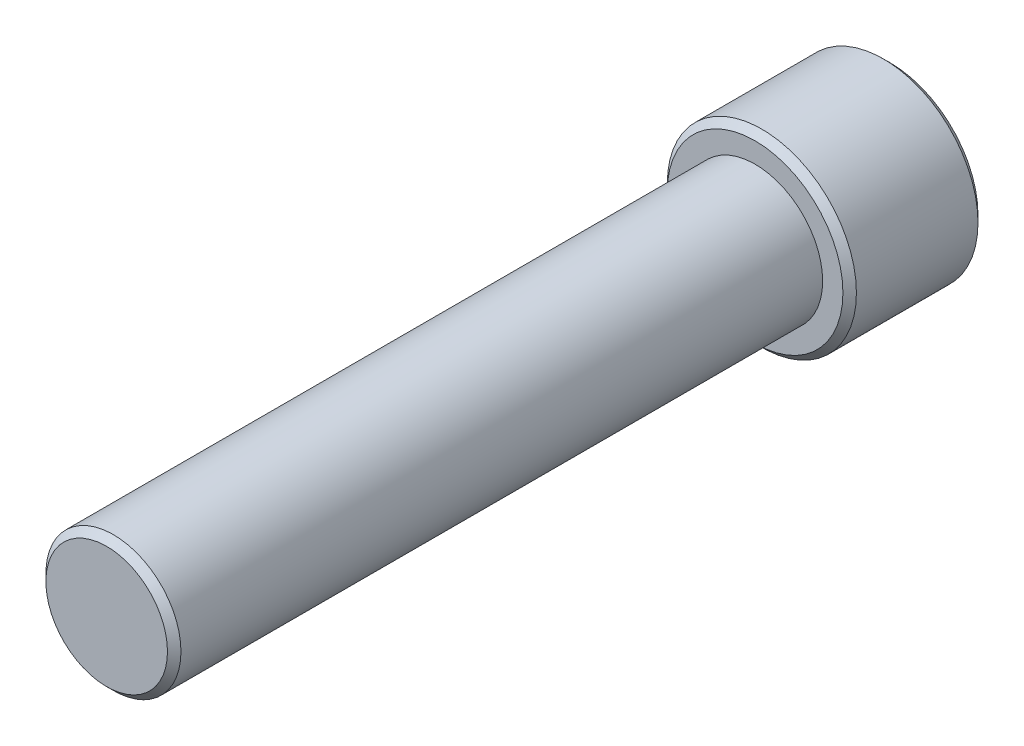
ISO-10303-21;
HEADER;
FILE_DESCRIPTION(('STEP AP214'),'2;1');
FILE_NAME('part.step','',(''),(''),'','','');
FILE_SCHEMA(('AUTOMOTIVE_DESIGN { 1 0 10303 214 1 1 1 1 }'));
ENDSEC;
DATA;
#1=APPLICATION_CONTEXT('core data for automotive mechanical design processes');
#2=APPLICATION_PROTOCOL_DEFINITION('international standard','automotive_design',2000,#1);
#3=PRODUCT_CONTEXT('',#1,'mechanical');
#4=PRODUCT('Part','Part','',(#3));
#5=PRODUCT_RELATED_PRODUCT_CATEGORY('part','',(#4));
#6=PRODUCT_DEFINITION_FORMATION('','',#4);
#7=PRODUCT_DEFINITION_CONTEXT('part definition',#1,'design');
#8=PRODUCT_DEFINITION('design','',#6,#7);
#9=PRODUCT_DEFINITION_SHAPE('','',#8);
#10=(LENGTH_UNIT() NAMED_UNIT(*) SI_UNIT(.MILLI.,.METRE.));
#11=(NAMED_UNIT(*) PLANE_ANGLE_UNIT() SI_UNIT($,.RADIAN.));
#12=(NAMED_UNIT(*) SI_UNIT($,.STERADIAN.) SOLID_ANGLE_UNIT());
#13=UNCERTAINTY_MEASURE_WITH_UNIT(LENGTH_MEASURE(1.E-05),#10,'distance_accuracy_value','');
#14=(GEOMETRIC_REPRESENTATION_CONTEXT(3) GLOBAL_UNCERTAINTY_ASSIGNED_CONTEXT((#13)) GLOBAL_UNIT_ASSIGNED_CONTEXT((#10,
#11,#12)) REPRESENTATION_CONTEXT('',''));
#15=CARTESIAN_POINT('',(0.,0.,0.));
#16=DIRECTION('',(0.,0.,1.));
#17=DIRECTION('',(1.,0.,0.));
#18=AXIS2_PLACEMENT_3D('',#15,#16,#17);
#19=CARTESIAN_POINT('',(0.,0.,5.));
#20=DIRECTION('',(0.,0.,-1.));
#21=DIRECTION('',(-1.,0.,0.));
#22=AXIS2_PLACEMENT_3D('',#19,#20,#21);
#23=CYLINDRICAL_SURFACE('',#22,3.5);
#24=CARTESIAN_POINT('',(0.,0.,0.249999999999996));
#25=DIRECTION('',(0.,0.,1.));
#26=DIRECTION('',(1.,0.,0.));
#27=AXIS2_PLACEMENT_3D('',#24,#25,#26);
#28=CIRCLE('',#27,3.5);
#29=CARTESIAN_POINT('',(3.5,0.,0.249999999999996));
#30=VERTEX_POINT('',#29);
#31=EDGE_CURVE('E54',#30,#30,#28,.T.);
#32=ORIENTED_EDGE('',*,*,#31,.T.);
#33=EDGE_LOOP('',(#32));
#34=FACE_BOUND('',#33,.T.);
#35=CARTESIAN_POINT('',(0.,0.,4.75));
#36=DIRECTION('',(0.,0.,1.));
#37=DIRECTION('',(1.,0.,0.));
#38=AXIS2_PLACEMENT_3D('',#35,#36,#37);
#39=CIRCLE('',#38,3.5);
#40=CARTESIAN_POINT('',(3.5,0.,4.75));
#41=VERTEX_POINT('',#40);
#42=EDGE_CURVE('E57',#41,#41,#39,.F.);
#43=ORIENTED_EDGE('',*,*,#42,.T.);
#44=EDGE_LOOP('',(#43));
#45=FACE_BOUND('',#44,.T.);
#46=ADVANCED_FACE('F33',(#34,#45),#23,.T.);
#47=CARTESIAN_POINT('',(0.,0.,5.));
#48=DIRECTION('',(0.,0.,1.));
#49=DIRECTION('',(1.,0.,0.));
#50=AXIS2_PLACEMENT_3D('',#47,#48,#49);
#51=PLANE('',#50);
#52=CARTESIAN_POINT('',(0.,0.,5.));
#53=DIRECTION('',(0.,0.,1.));
#54=DIRECTION('',(1.,0.,0.));
#55=AXIS2_PLACEMENT_3D('',#52,#53,#54);
#56=CIRCLE('',#55,3.25);
#57=CARTESIAN_POINT('',(3.25,0.,5.));
#58=VERTEX_POINT('',#57);
#59=EDGE_CURVE('E45',#58,#58,#56,.T.);
#60=ORIENTED_EDGE('',*,*,#59,.T.);
#61=EDGE_LOOP('',(#60));
#62=FACE_BOUND('',#61,.T.);
#63=CARTESIAN_POINT('',(0.,0.,5.));
#64=DIRECTION('',(0.,0.,1.));
#65=DIRECTION('',(1.,0.,0.));
#66=AXIS2_PLACEMENT_3D('',#63,#64,#65);
#67=CIRCLE('',#66,2.5);
#68=CARTESIAN_POINT('',(2.5,0.,5.));
#69=VERTEX_POINT('',#68);
#70=EDGE_CURVE('E60',#69,#69,#67,.T.);
#71=ORIENTED_EDGE('',*,*,#70,.F.);
#72=EDGE_LOOP('',(#71));
#73=FACE_BOUND('',#72,.T.);
#74=ADVANCED_FACE('F66',(#62,#73),#51,.T.);
#75=CARTESIAN_POINT('',(0.,0.,0.));
#76=DIRECTION('',(0.,0.,1.));
#77=DIRECTION('',(1.,0.,0.));
#78=AXIS2_PLACEMENT_3D('',#75,#76,#77);
#79=PLANE('',#78);
#80=CARTESIAN_POINT('',(0.,0.,0.));
#81=DIRECTION('',(0.,0.,1.));
#82=DIRECTION('',(1.,0.,0.));
#83=AXIS2_PLACEMENT_3D('',#80,#81,#82);
#84=CIRCLE('',#83,3.25000000000001);
#85=CARTESIAN_POINT('',(3.25000000000001,0.,0.));
#86=VERTEX_POINT('',#85);
#87=EDGE_CURVE('E49',#86,#86,#84,.F.);
#88=ORIENTED_EDGE('',*,*,#87,.T.);
#89=EDGE_LOOP('',(#88));
#90=FACE_BOUND('',#89,.T.);
#91=ADVANCED_FACE('F68',(#90),#79,.F.);
#92=CARTESIAN_POINT('',(0.,0.,29.));
#93=DIRECTION('',(0.,0.,-1.));
#94=DIRECTION('',(-1.,0.,0.));
#95=AXIS2_PLACEMENT_3D('',#92,#93,#94);
#96=CYLINDRICAL_SURFACE('',#95,2.5);
#97=CARTESIAN_POINT('',(0.,0.,28.75));
#98=DIRECTION('',(0.,0.,1.));
#99=DIRECTION('',(1.,0.,0.));
#100=AXIS2_PLACEMENT_3D('',#97,#98,#99);
#101=CIRCLE('',#100,2.5);
#102=CARTESIAN_POINT('',(2.5,0.,28.75));
#103=VERTEX_POINT('',#102);
#104=EDGE_CURVE('E10',#103,#103,#101,.F.);
#105=ORIENTED_EDGE('',*,*,#104,.T.);
#106=EDGE_LOOP('',(#105));
#107=FACE_BOUND('',#106,.T.);
#108=ORIENTED_EDGE('',*,*,#70,.T.);
#109=EDGE_LOOP('',(#108));
#110=FACE_BOUND('',#109,.T.);
#111=ADVANCED_FACE('F64',(#107,#110),#96,.T.);
#112=CARTESIAN_POINT('',(0.,0.,29.));
#113=DIRECTION('',(0.,0.,1.));
#114=DIRECTION('',(1.,0.,0.));
#115=AXIS2_PLACEMENT_3D('',#112,#113,#114);
#116=PLANE('',#115);
#117=CARTESIAN_POINT('',(0.,0.,29.));
#118=DIRECTION('',(0.,0.,1.));
#119=DIRECTION('',(1.,0.,0.));
#120=AXIS2_PLACEMENT_3D('',#117,#118,#119);
#121=CIRCLE('',#120,2.25);
#122=CARTESIAN_POINT('',(2.25,0.,29.));
#123=VERTEX_POINT('',#122);
#124=EDGE_CURVE('E41',#123,#123,#121,.T.);
#125=ORIENTED_EDGE('',*,*,#124,.T.);
#126=EDGE_LOOP('',(#125));
#127=FACE_BOUND('',#126,.T.);
#128=ADVANCED_FACE('F89',(#127),#116,.T.);
#129=CARTESIAN_POINT('',(0.,0.,0.249999999999996));
#130=DIRECTION('',(0.,0.,1.));
#131=DIRECTION('',(1.,0.,0.));
#132=AXIS2_PLACEMENT_3D('',#129,#130,#131);
#133=CONICAL_SURFACE('',#132,3.5,0.785398163397444);
#134=ORIENTED_EDGE('',*,*,#87,.F.);
#135=EDGE_LOOP('',(#134));
#136=FACE_BOUND('',#135,.T.);
#137=ORIENTED_EDGE('',*,*,#31,.F.);
#138=EDGE_LOOP('',(#137));
#139=FACE_BOUND('',#138,.T.);
#140=ADVANCED_FACE('F83',(#136,#139),#133,.T.);
#141=CARTESIAN_POINT('',(0.,0.,5.));
#142=DIRECTION('',(0.,0.,-1.));
#143=DIRECTION('',(-1.,0.,0.));
#144=AXIS2_PLACEMENT_3D('',#141,#142,#143);
#145=CONICAL_SURFACE('',#144,3.25,0.785398163397446);
#146=ORIENTED_EDGE('',*,*,#42,.F.);
#147=EDGE_LOOP('',(#146));
#148=FACE_BOUND('',#147,.T.);
#149=ORIENTED_EDGE('',*,*,#59,.F.);
#150=EDGE_LOOP('',(#149));
#151=FACE_BOUND('',#150,.T.);
#152=ADVANCED_FACE('F88',(#148,#151),#145,.T.);
#153=CARTESIAN_POINT('',(0.,0.,29.));
#154=DIRECTION('',(0.,0.,-1.));
#155=DIRECTION('',(-1.,0.,0.));
#156=AXIS2_PLACEMENT_3D('',#153,#154,#155);
#157=CONICAL_SURFACE('',#156,2.25,0.785398163397444);
#158=ORIENTED_EDGE('',*,*,#104,.F.);
#159=EDGE_LOOP('',(#158));
#160=FACE_BOUND('',#159,.T.);
#161=ORIENTED_EDGE('',*,*,#124,.F.);
#162=EDGE_LOOP('',(#161));
#163=FACE_BOUND('',#162,.T.);
#164=ADVANCED_FACE('F36',(#160,#163),#157,.T.);
#165=CLOSED_SHELL('',(#46,#74,#91,#111,#128,#140,#152,#164));
#166=MANIFOLD_SOLID_BREP('B2',#165);
#167=ADVANCED_BREP_SHAPE_REPRESENTATION('',(#18,#166),#14);
#168=SHAPE_DEFINITION_REPRESENTATION(#9,#167);
ENDSEC;
END-ISO-10303-21;
